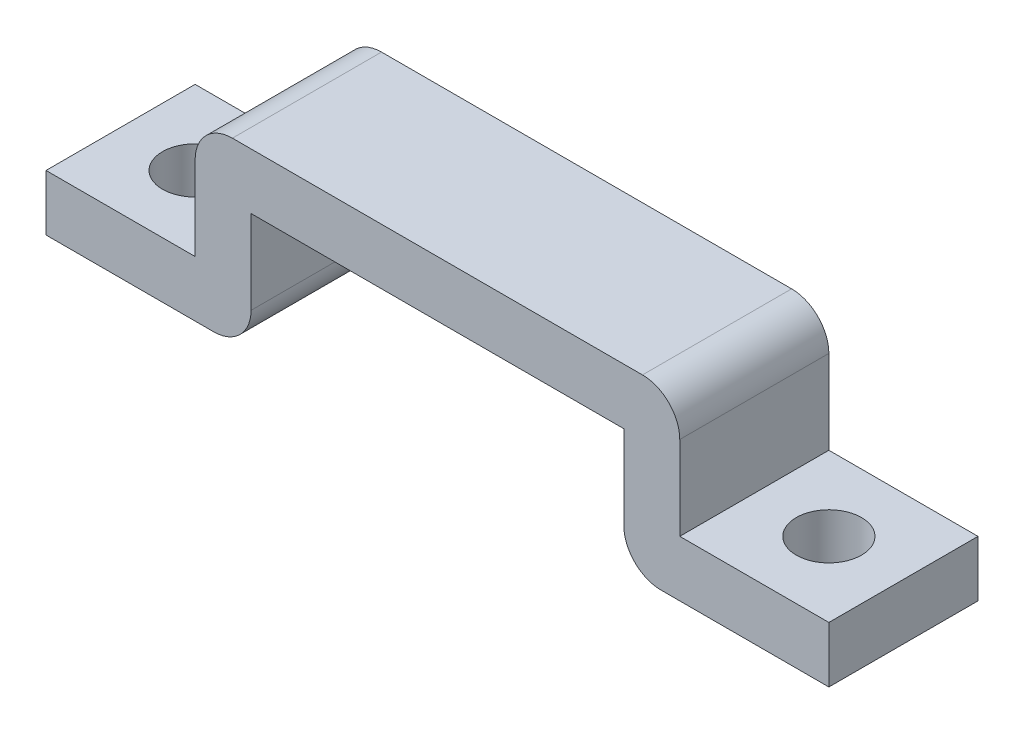
ISO-10303-21;
HEADER;
FILE_DESCRIPTION(('STEP AP214'),'2;1');
FILE_NAME('part.step','',(''),(''),'','','');
FILE_SCHEMA(('AUTOMOTIVE_DESIGN { 1 0 10303 214 1 1 1 1 }'));
ENDSEC;
DATA;
#1=APPLICATION_CONTEXT('core data for automotive mechanical design processes');
#2=APPLICATION_PROTOCOL_DEFINITION('international standard','automotive_design',2000,#1);
#3=PRODUCT_CONTEXT('',#1,'mechanical');
#4=PRODUCT('Part','Part','',(#3));
#5=PRODUCT_RELATED_PRODUCT_CATEGORY('part','',(#4));
#6=PRODUCT_DEFINITION_FORMATION('','',#4);
#7=PRODUCT_DEFINITION_CONTEXT('part definition',#1,'design');
#8=PRODUCT_DEFINITION('design','',#6,#7);
#9=PRODUCT_DEFINITION_SHAPE('','',#8);
#10=(LENGTH_UNIT() NAMED_UNIT(*) SI_UNIT(.MILLI.,.METRE.));
#11=(NAMED_UNIT(*) PLANE_ANGLE_UNIT() SI_UNIT($,.RADIAN.));
#12=(NAMED_UNIT(*) SI_UNIT($,.STERADIAN.) SOLID_ANGLE_UNIT());
#13=UNCERTAINTY_MEASURE_WITH_UNIT(LENGTH_MEASURE(1.E-05),#10,'distance_accuracy_value','');
#14=(GEOMETRIC_REPRESENTATION_CONTEXT(3) GLOBAL_UNCERTAINTY_ASSIGNED_CONTEXT((#13)) GLOBAL_UNIT_ASSIGNED_CONTEXT((#10,
#11,#12)) REPRESENTATION_CONTEXT('',''));
#15=CARTESIAN_POINT('',(0.,0.,0.));
#16=DIRECTION('',(0.,0.,1.));
#17=DIRECTION('',(1.,0.,0.));
#18=AXIS2_PLACEMENT_3D('',#15,#16,#17);
#19=CARTESIAN_POINT('',(10.,2.00000000000002,8.));
#20=DIRECTION('',(1.,0.,0.));
#21=DIRECTION('',(0.,0.,-1.));
#22=AXIS2_PLACEMENT_3D('',#19,#20,#21);
#23=PLANE('',#22);
#24=DIRECTION('',(0.,-1.,0.));
#25=VECTOR('',#24,1.);
#26=CARTESIAN_POINT('',(10.,2.00000000000002,0.));
#27=LINE('',#26,#25);
#28=CARTESIAN_POINT('',(10.,6.5,0.));
#29=VERTEX_POINT('',#28);
#30=CARTESIAN_POINT('',(10.,2.00000000000002,0.));
#31=VERTEX_POINT('',#30);
#32=EDGE_CURVE('E177',#29,#31,#27,.T.);
#33=ORIENTED_EDGE('',*,*,#32,.T.);
#34=DIRECTION('',(0.,0.,-1.));
#35=VECTOR('',#34,1.);
#36=CARTESIAN_POINT('',(10.,2.00000000000002,8.));
#37=LINE('',#36,#35);
#38=CARTESIAN_POINT('',(10.,2.00000000000002,8.));
#39=VERTEX_POINT('',#38);
#40=EDGE_CURVE('E11',#39,#31,#37,.T.);
#41=ORIENTED_EDGE('',*,*,#40,.F.);
#42=DIRECTION('',(0.,-1.,0.));
#43=VECTOR('',#42,1.);
#44=CARTESIAN_POINT('',(10.,2.00000000000002,8.));
#45=LINE('',#44,#43);
#46=CARTESIAN_POINT('',(10.,6.5,8.));
#47=VERTEX_POINT('',#46);
#48=EDGE_CURVE('E208',#47,#39,#45,.T.);
#49=ORIENTED_EDGE('',*,*,#48,.F.);
#50=DIRECTION('',(0.,0.,-1.));
#51=VECTOR('',#50,1.);
#52=CARTESIAN_POINT('',(10.,6.5,8.));
#53=LINE('',#52,#51);
#54=EDGE_CURVE('E173',#47,#29,#53,.T.);
#55=ORIENTED_EDGE('',*,*,#54,.T.);
#56=EDGE_LOOP('',(#33,#41,#49,#55));
#57=FACE_BOUND('',#56,.T.);
#58=ADVANCED_FACE('F33',(#57),#23,.F.);
#59=CARTESIAN_POINT('',(12.,2.,8.));
#60=DIRECTION('',(0.,0.,-1.));
#61=DIRECTION('',(-1.,0.,0.));
#62=AXIS2_PLACEMENT_3D('',#59,#60,#61);
#63=CYLINDRICAL_SURFACE('',#62,2.);
#64=CARTESIAN_POINT('',(12.,2.,0.));
#65=DIRECTION('',(0.,0.,1.));
#66=DIRECTION('',(1.,0.,0.));
#67=AXIS2_PLACEMENT_3D('',#64,#65,#66);
#68=CIRCLE('',#67,2.);
#69=CARTESIAN_POINT('',(12.,0.,0.));
#70=VERTEX_POINT('',#69);
#71=EDGE_CURVE('E180',#31,#70,#68,.T.);
#72=ORIENTED_EDGE('',*,*,#71,.T.);
#73=DIRECTION('',(0.,0.,-1.));
#74=VECTOR('',#73,1.);
#75=CARTESIAN_POINT('',(12.,0.,8.));
#76=LINE('',#75,#74);
#77=CARTESIAN_POINT('',(12.,0.,8.));
#78=VERTEX_POINT('',#77);
#79=EDGE_CURVE('E41',#78,#70,#76,.T.);
#80=ORIENTED_EDGE('',*,*,#79,.F.);
#81=CARTESIAN_POINT('',(12.,2.,8.));
#82=DIRECTION('',(0.,0.,1.));
#83=DIRECTION('',(1.,0.,0.));
#84=AXIS2_PLACEMENT_3D('',#81,#82,#83);
#85=CIRCLE('',#84,2.);
#86=EDGE_CURVE('E116',#39,#78,#85,.T.);
#87=ORIENTED_EDGE('',*,*,#86,.F.);
#88=ORIENTED_EDGE('',*,*,#40,.T.);
#89=EDGE_LOOP('',(#72,#80,#87,#88));
#90=FACE_BOUND('',#89,.T.);
#91=ADVANCED_FACE('F306',(#90),#63,.T.);
#92=CARTESIAN_POINT('',(21.,0.,8.));
#93=DIRECTION('',(0.,1.,0.));
#94=DIRECTION('',(-1.,0.,0.));
#95=AXIS2_PLACEMENT_3D('',#92,#93,#94);
#96=PLANE('',#95);
#97=CARTESIAN_POINT('',(17.,0.,3.99999999999999));
#98=DIRECTION('',(0.,1.,0.));
#99=DIRECTION('',(1.,0.,0.));
#100=AXIS2_PLACEMENT_3D('',#97,#98,#99);
#101=CIRCLE('',#100,1.75);
#102=CARTESIAN_POINT('',(18.75,0.,3.99999999999999));
#103=VERTEX_POINT('',#102);
#104=EDGE_CURVE('E431',#103,#103,#101,.T.);
#105=ORIENTED_EDGE('',*,*,#104,.T.);
#106=EDGE_LOOP('',(#105));
#107=FACE_BOUND('',#106,.T.);
#108=DIRECTION('',(1.,0.,0.));
#109=VECTOR('',#108,1.);
#110=CARTESIAN_POINT('',(21.,0.,0.));
#111=LINE('',#110,#109);
#112=CARTESIAN_POINT('',(21.,0.,0.));
#113=VERTEX_POINT('',#112);
#114=EDGE_CURVE('E183',#70,#113,#111,.T.);
#115=ORIENTED_EDGE('',*,*,#114,.T.);
#116=DIRECTION('',(0.,0.,-1.));
#117=VECTOR('',#116,1.);
#118=CARTESIAN_POINT('',(21.,0.,8.));
#119=LINE('',#118,#117);
#120=CARTESIAN_POINT('',(21.,0.,8.));
#121=VERTEX_POINT('',#120);
#122=EDGE_CURVE('E239',#121,#113,#119,.T.);
#123=ORIENTED_EDGE('',*,*,#122,.F.);
#124=DIRECTION('',(1.,0.,0.));
#125=VECTOR('',#124,1.);
#126=CARTESIAN_POINT('',(21.,0.,8.));
#127=LINE('',#126,#125);
#128=EDGE_CURVE('E247',#78,#121,#127,.T.);
#129=ORIENTED_EDGE('',*,*,#128,.F.);
#130=ORIENTED_EDGE('',*,*,#79,.T.);
#131=EDGE_LOOP('',(#115,#123,#129,#130));
#132=FACE_BOUND('',#131,.T.);
#133=ADVANCED_FACE('F245',(#107,#132),#96,.F.);
#134=CARTESIAN_POINT('',(21.,3.00000000000001,8.));
#135=DIRECTION('',(-1.,0.,0.));
#136=DIRECTION('',(0.,-1.,0.));
#137=AXIS2_PLACEMENT_3D('',#134,#135,#136);
#138=PLANE('',#137);
#139=DIRECTION('',(0.,1.,0.));
#140=VECTOR('',#139,1.);
#141=CARTESIAN_POINT('',(21.,3.00000000000001,0.));
#142=LINE('',#141,#140);
#143=CARTESIAN_POINT('',(21.,3.00000000000001,0.));
#144=VERTEX_POINT('',#143);
#145=EDGE_CURVE('E185',#113,#144,#142,.T.);
#146=ORIENTED_EDGE('',*,*,#145,.T.);
#147=DIRECTION('',(0.,0.,-1.));
#148=VECTOR('',#147,1.);
#149=CARTESIAN_POINT('',(21.,3.00000000000001,8.));
#150=LINE('',#149,#148);
#151=CARTESIAN_POINT('',(21.,3.00000000000001,8.));
#152=VERTEX_POINT('',#151);
#153=EDGE_CURVE('E236',#152,#144,#150,.T.);
#154=ORIENTED_EDGE('',*,*,#153,.F.);
#155=DIRECTION('',(0.,1.,0.));
#156=VECTOR('',#155,1.);
#157=CARTESIAN_POINT('',(21.,3.00000000000001,8.));
#158=LINE('',#157,#156);
#159=EDGE_CURVE('E265',#121,#152,#158,.T.);
#160=ORIENTED_EDGE('',*,*,#159,.F.);
#161=ORIENTED_EDGE('',*,*,#122,.T.);
#162=EDGE_LOOP('',(#146,#154,#160,#161));
#163=FACE_BOUND('',#162,.T.);
#164=ADVANCED_FACE('F256',(#163),#138,.F.);
#165=CARTESIAN_POINT('',(13.,3.,8.));
#166=DIRECTION('',(0.,-1.,0.));
#167=DIRECTION('',(1.,0.,0.));
#168=AXIS2_PLACEMENT_3D('',#165,#166,#167);
#169=PLANE('',#168);
#170=CARTESIAN_POINT('',(17.,3.00000000000001,3.99999999999999));
#171=DIRECTION('',(0.,1.,0.));
#172=DIRECTION('',(1.,0.,0.));
#173=AXIS2_PLACEMENT_3D('',#170,#171,#172);
#174=CIRCLE('',#173,1.75);
#175=CARTESIAN_POINT('',(18.75,3.00000000000001,3.99999999999999));
#176=VERTEX_POINT('',#175);
#177=EDGE_CURVE('E434',#176,#176,#174,.T.);
#178=ORIENTED_EDGE('',*,*,#177,.F.);
#179=EDGE_LOOP('',(#178));
#180=FACE_BOUND('',#179,.T.);
#181=DIRECTION('',(-1.,0.,0.));
#182=VECTOR('',#181,1.);
#183=CARTESIAN_POINT('',(13.,3.,0.));
#184=LINE('',#183,#182);
#185=CARTESIAN_POINT('',(13.,3.,0.));
#186=VERTEX_POINT('',#185);
#187=EDGE_CURVE('E187',#144,#186,#184,.T.);
#188=ORIENTED_EDGE('',*,*,#187,.T.);
#189=DIRECTION('',(0.,0.,-1.));
#190=VECTOR('',#189,1.);
#191=CARTESIAN_POINT('',(13.,3.,8.));
#192=LINE('',#191,#190);
#193=CARTESIAN_POINT('',(13.,3.,8.));
#194=VERTEX_POINT('',#193);
#195=EDGE_CURVE('E233',#194,#186,#192,.T.);
#196=ORIENTED_EDGE('',*,*,#195,.F.);
#197=DIRECTION('',(-1.,0.,0.));
#198=VECTOR('',#197,1.);
#199=CARTESIAN_POINT('',(13.,3.,8.));
#200=LINE('',#199,#198);
#201=EDGE_CURVE('E262',#152,#194,#200,.T.);
#202=ORIENTED_EDGE('',*,*,#201,.F.);
#203=ORIENTED_EDGE('',*,*,#153,.T.);
#204=EDGE_LOOP('',(#188,#196,#202,#203));
#205=FACE_BOUND('',#204,.T.);
#206=ADVANCED_FACE('F260',(#180,#205),#169,.F.);
#207=CARTESIAN_POINT('',(13.,7.49999999999999,8.));
#208=DIRECTION('',(-1.,0.,0.));
#209=DIRECTION('',(0.,-1.,0.));
#210=AXIS2_PLACEMENT_3D('',#207,#208,#209);
#211=PLANE('',#210);
#212=DIRECTION('',(0.,1.,0.));
#213=VECTOR('',#212,1.);
#214=CARTESIAN_POINT('',(13.,7.49999999999999,0.));
#215=LINE('',#214,#213);
#216=CARTESIAN_POINT('',(13.,7.49999999999999,0.));
#217=VERTEX_POINT('',#216);
#218=EDGE_CURVE('E189',#186,#217,#215,.T.);
#219=ORIENTED_EDGE('',*,*,#218,.T.);
#220=DIRECTION('',(0.,0.,-1.));
#221=VECTOR('',#220,1.);
#222=CARTESIAN_POINT('',(13.,7.49999999999999,8.));
#223=LINE('',#222,#221);
#224=CARTESIAN_POINT('',(13.,7.49999999999999,8.));
#225=VERTEX_POINT('',#224);
#226=EDGE_CURVE('E230',#225,#217,#223,.T.);
#227=ORIENTED_EDGE('',*,*,#226,.F.);
#228=DIRECTION('',(0.,1.,0.));
#229=VECTOR('',#228,1.);
#230=CARTESIAN_POINT('',(13.,7.49999999999999,8.));
#231=LINE('',#230,#229);
#232=EDGE_CURVE('E264',#194,#225,#231,.T.);
#233=ORIENTED_EDGE('',*,*,#232,.F.);
#234=ORIENTED_EDGE('',*,*,#195,.T.);
#235=EDGE_LOOP('',(#219,#227,#233,#234));
#236=FACE_BOUND('',#235,.T.);
#237=ADVANCED_FACE('F320',(#236),#211,.F.);
#238=CARTESIAN_POINT('',(11.,7.5,8.));
#239=DIRECTION('',(0.,0.,-1.));
#240=DIRECTION('',(-1.,0.,0.));
#241=AXIS2_PLACEMENT_3D('',#238,#239,#240);
#242=CYLINDRICAL_SURFACE('',#241,2.);
#243=CARTESIAN_POINT('',(11.,7.5,0.));
#244=DIRECTION('',(0.,0.,1.));
#245=DIRECTION('',(1.,0.,0.));
#246=AXIS2_PLACEMENT_3D('',#243,#244,#245);
#247=CIRCLE('',#246,2.);
#248=CARTESIAN_POINT('',(11.,9.5,0.));
#249=VERTEX_POINT('',#248);
#250=EDGE_CURVE('E191',#217,#249,#247,.T.);
#251=ORIENTED_EDGE('',*,*,#250,.T.);
#252=DIRECTION('',(0.,0.,-1.));
#253=VECTOR('',#252,1.);
#254=CARTESIAN_POINT('',(11.,9.5,8.));
#255=LINE('',#254,#253);
#256=CARTESIAN_POINT('',(11.,9.5,8.));
#257=VERTEX_POINT('',#256);
#258=EDGE_CURVE('E227',#257,#249,#255,.T.);
#259=ORIENTED_EDGE('',*,*,#258,.F.);
#260=CARTESIAN_POINT('',(11.,7.5,8.));
#261=DIRECTION('',(0.,0.,1.));
#262=DIRECTION('',(1.,0.,0.));
#263=AXIS2_PLACEMENT_3D('',#260,#261,#262);
#264=CIRCLE('',#263,2.);
#265=EDGE_CURVE('E267',#225,#257,#264,.T.);
#266=ORIENTED_EDGE('',*,*,#265,.F.);
#267=ORIENTED_EDGE('',*,*,#226,.T.);
#268=EDGE_LOOP('',(#251,#259,#266,#267));
#269=FACE_BOUND('',#268,.T.);
#270=ADVANCED_FACE('F324',(#269),#242,.T.);
#271=CARTESIAN_POINT('',(11.,9.5,8.));
#272=DIRECTION('',(0.,-1.,0.));
#273=DIRECTION('',(0.,0.,-1.));
#274=AXIS2_PLACEMENT_3D('',#271,#272,#273);
#275=PLANE('',#274);
#276=DIRECTION('',(-1.,0.,0.));
#277=VECTOR('',#276,1.);
#278=CARTESIAN_POINT('',(11.,9.5,0.));
#279=LINE('',#278,#277);
#280=CARTESIAN_POINT('',(-11.,9.5,0.));
#281=VERTEX_POINT('',#280);
#282=EDGE_CURVE('E193',#249,#281,#279,.T.);
#283=ORIENTED_EDGE('',*,*,#282,.T.);
#284=DIRECTION('',(0.,0.,-1.));
#285=VECTOR('',#284,1.);
#286=CARTESIAN_POINT('',(-11.,9.5,8.));
#287=LINE('',#286,#285);
#288=CARTESIAN_POINT('',(-11.,9.5,8.));
#289=VERTEX_POINT('',#288);
#290=EDGE_CURVE('E224',#289,#281,#287,.T.);
#291=ORIENTED_EDGE('',*,*,#290,.F.);
#292=DIRECTION('',(-1.,0.,0.));
#293=VECTOR('',#292,1.);
#294=CARTESIAN_POINT('',(11.,9.5,8.));
#295=LINE('',#294,#293);
#296=EDGE_CURVE('E273',#257,#289,#295,.T.);
#297=ORIENTED_EDGE('',*,*,#296,.F.);
#298=ORIENTED_EDGE('',*,*,#258,.T.);
#299=EDGE_LOOP('',(#283,#291,#297,#298));
#300=FACE_BOUND('',#299,.T.);
#301=ADVANCED_FACE('F328',(#300),#275,.F.);
#302=CARTESIAN_POINT('',(-11.,7.5,8.));
#303=DIRECTION('',(0.,0.,-1.));
#304=DIRECTION('',(-1.,0.,0.));
#305=AXIS2_PLACEMENT_3D('',#302,#303,#304);
#306=CYLINDRICAL_SURFACE('',#305,2.);
#307=CARTESIAN_POINT('',(-11.,7.5,0.));
#308=DIRECTION('',(0.,0.,1.));
#309=DIRECTION('',(1.,0.,0.));
#310=AXIS2_PLACEMENT_3D('',#307,#308,#309);
#311=CIRCLE('',#310,2.);
#312=CARTESIAN_POINT('',(-13.,7.49999999999999,0.));
#313=VERTEX_POINT('',#312);
#314=EDGE_CURVE('E195',#281,#313,#311,.T.);
#315=ORIENTED_EDGE('',*,*,#314,.T.);
#316=DIRECTION('',(0.,0.,-1.));
#317=VECTOR('',#316,1.);
#318=CARTESIAN_POINT('',(-13.,7.49999999999999,8.));
#319=LINE('',#318,#317);
#320=CARTESIAN_POINT('',(-13.,7.49999999999999,8.));
#321=VERTEX_POINT('',#320);
#322=EDGE_CURVE('E221',#321,#313,#319,.T.);
#323=ORIENTED_EDGE('',*,*,#322,.F.);
#324=CARTESIAN_POINT('',(-11.,7.5,8.));
#325=DIRECTION('',(0.,0.,1.));
#326=DIRECTION('',(1.,0.,0.));
#327=AXIS2_PLACEMENT_3D('',#324,#325,#326);
#328=CIRCLE('',#327,2.);
#329=EDGE_CURVE('E275',#289,#321,#328,.T.);
#330=ORIENTED_EDGE('',*,*,#329,.F.);
#331=ORIENTED_EDGE('',*,*,#290,.T.);
#332=EDGE_LOOP('',(#315,#323,#330,#331));
#333=FACE_BOUND('',#332,.T.);
#334=ADVANCED_FACE('F332',(#333),#306,.T.);
#335=CARTESIAN_POINT('',(-13.,7.49999999999999,8.));
#336=DIRECTION('',(1.,0.,0.));
#337=DIRECTION('',(0.,1.,0.));
#338=AXIS2_PLACEMENT_3D('',#335,#336,#337);
#339=PLANE('',#338);
#340=DIRECTION('',(0.,-1.,0.));
#341=VECTOR('',#340,1.);
#342=CARTESIAN_POINT('',(-13.,7.49999999999999,0.));
#343=LINE('',#342,#341);
#344=CARTESIAN_POINT('',(-13.,3.,0.));
#345=VERTEX_POINT('',#344);
#346=EDGE_CURVE('E197',#313,#345,#343,.T.);
#347=ORIENTED_EDGE('',*,*,#346,.T.);
#348=DIRECTION('',(0.,0.,-1.));
#349=VECTOR('',#348,1.);
#350=CARTESIAN_POINT('',(-13.,3.,8.));
#351=LINE('',#350,#349);
#352=CARTESIAN_POINT('',(-13.,3.,8.));
#353=VERTEX_POINT('',#352);
#354=EDGE_CURVE('E218',#353,#345,#351,.T.);
#355=ORIENTED_EDGE('',*,*,#354,.F.);
#356=DIRECTION('',(0.,-1.,0.));
#357=VECTOR('',#356,1.);
#358=CARTESIAN_POINT('',(-13.,7.49999999999999,8.));
#359=LINE('',#358,#357);
#360=EDGE_CURVE('E277',#321,#353,#359,.T.);
#361=ORIENTED_EDGE('',*,*,#360,.F.);
#362=ORIENTED_EDGE('',*,*,#322,.T.);
#363=EDGE_LOOP('',(#347,#355,#361,#362));
#364=FACE_BOUND('',#363,.T.);
#365=ADVANCED_FACE('F336',(#364),#339,.F.);
#366=CARTESIAN_POINT('',(-13.,3.,8.));
#367=DIRECTION('',(0.,-1.,0.));
#368=DIRECTION('',(1.,0.,0.));
#369=AXIS2_PLACEMENT_3D('',#366,#367,#368);
#370=PLANE('',#369);
#371=CARTESIAN_POINT('',(-17.,3.00000000000001,4.));
#372=DIRECTION('',(0.,1.,0.));
#373=DIRECTION('',(-1.,0.,0.));
#374=AXIS2_PLACEMENT_3D('',#371,#372,#373);
#375=CIRCLE('',#374,1.75);
#376=CARTESIAN_POINT('',(-18.75,3.00000000000001,4.));
#377=VERTEX_POINT('',#376);
#378=EDGE_CURVE('E436',#377,#377,#375,.T.);
#379=ORIENTED_EDGE('',*,*,#378,.F.);
#380=EDGE_LOOP('',(#379));
#381=FACE_BOUND('',#380,.T.);
#382=DIRECTION('',(-1.,0.,0.));
#383=VECTOR('',#382,1.);
#384=CARTESIAN_POINT('',(-13.,3.,0.));
#385=LINE('',#384,#383);
#386=CARTESIAN_POINT('',(-21.,3.,0.));
#387=VERTEX_POINT('',#386);
#388=EDGE_CURVE('E199',#345,#387,#385,.T.);
#389=ORIENTED_EDGE('',*,*,#388,.T.);
#390=DIRECTION('',(0.,0.,-1.));
#391=VECTOR('',#390,1.);
#392=CARTESIAN_POINT('',(-21.,3.,8.));
#393=LINE('',#392,#391);
#394=CARTESIAN_POINT('',(-21.,3.,8.));
#395=VERTEX_POINT('',#394);
#396=EDGE_CURVE('E215',#395,#387,#393,.T.);
#397=ORIENTED_EDGE('',*,*,#396,.F.);
#398=DIRECTION('',(-1.,0.,0.));
#399=VECTOR('',#398,1.);
#400=CARTESIAN_POINT('',(-13.,3.,8.));
#401=LINE('',#400,#399);
#402=EDGE_CURVE('E279',#353,#395,#401,.T.);
#403=ORIENTED_EDGE('',*,*,#402,.F.);
#404=ORIENTED_EDGE('',*,*,#354,.T.);
#405=EDGE_LOOP('',(#389,#397,#403,#404));
#406=FACE_BOUND('',#405,.T.);
#407=ADVANCED_FACE('F340',(#381,#406),#370,.F.);
#408=CARTESIAN_POINT('',(-21.,3.,8.));
#409=DIRECTION('',(1.,0.,0.));
#410=DIRECTION('',(0.,0.,-1.));
#411=AXIS2_PLACEMENT_3D('',#408,#409,#410);
#412=PLANE('',#411);
#413=DIRECTION('',(0.,-1.,0.));
#414=VECTOR('',#413,1.);
#415=CARTESIAN_POINT('',(-21.,3.,0.));
#416=LINE('',#415,#414);
#417=CARTESIAN_POINT('',(-21.,0.,0.));
#418=VERTEX_POINT('',#417);
#419=EDGE_CURVE('E201',#387,#418,#416,.T.);
#420=ORIENTED_EDGE('',*,*,#419,.T.);
#421=DIRECTION('',(0.,0.,-1.));
#422=VECTOR('',#421,1.);
#423=CARTESIAN_POINT('',(-21.,0.,8.));
#424=LINE('',#423,#422);
#425=CARTESIAN_POINT('',(-21.,0.,8.));
#426=VERTEX_POINT('',#425);
#427=EDGE_CURVE('E212',#426,#418,#424,.T.);
#428=ORIENTED_EDGE('',*,*,#427,.F.);
#429=DIRECTION('',(0.,-1.,0.));
#430=VECTOR('',#429,1.);
#431=CARTESIAN_POINT('',(-21.,3.,8.));
#432=LINE('',#431,#430);
#433=EDGE_CURVE('E281',#395,#426,#432,.T.);
#434=ORIENTED_EDGE('',*,*,#433,.F.);
#435=ORIENTED_EDGE('',*,*,#396,.T.);
#436=EDGE_LOOP('',(#420,#428,#434,#435));
#437=FACE_BOUND('',#436,.T.);
#438=ADVANCED_FACE('F287',(#437),#412,.F.);
#439=CARTESIAN_POINT('',(-21.,0.,8.));
#440=DIRECTION('',(0.,1.,0.));
#441=DIRECTION('',(-1.,0.,0.));
#442=AXIS2_PLACEMENT_3D('',#439,#440,#441);
#443=PLANE('',#442);
#444=CARTESIAN_POINT('',(-17.,0.,4.));
#445=DIRECTION('',(0.,1.,0.));
#446=DIRECTION('',(-1.,0.,0.));
#447=AXIS2_PLACEMENT_3D('',#444,#445,#446);
#448=CIRCLE('',#447,1.75);
#449=CARTESIAN_POINT('',(-18.75,0.,4.));
#450=VERTEX_POINT('',#449);
#451=EDGE_CURVE('E181',#450,#450,#448,.T.);
#452=ORIENTED_EDGE('',*,*,#451,.T.);
#453=EDGE_LOOP('',(#452));
#454=FACE_BOUND('',#453,.T.);
#455=DIRECTION('',(1.,0.,0.));
#456=VECTOR('',#455,1.);
#457=CARTESIAN_POINT('',(-21.,0.,0.));
#458=LINE('',#457,#456);
#459=CARTESIAN_POINT('',(-12.,0.,0.));
#460=VERTEX_POINT('',#459);
#461=EDGE_CURVE('E203',#418,#460,#458,.T.);
#462=ORIENTED_EDGE('',*,*,#461,.T.);
#463=DIRECTION('',(0.,0.,-1.));
#464=VECTOR('',#463,1.);
#465=CARTESIAN_POINT('',(-12.,0.,8.));
#466=LINE('',#465,#464);
#467=CARTESIAN_POINT('',(-12.,0.,8.));
#468=VERTEX_POINT('',#467);
#469=EDGE_CURVE('E168',#468,#460,#466,.T.);
#470=ORIENTED_EDGE('',*,*,#469,.F.);
#471=DIRECTION('',(1.,0.,0.));
#472=VECTOR('',#471,1.);
#473=CARTESIAN_POINT('',(-21.,0.,8.));
#474=LINE('',#473,#472);
#475=EDGE_CURVE('E159',#426,#468,#474,.T.);
#476=ORIENTED_EDGE('',*,*,#475,.F.);
#477=ORIENTED_EDGE('',*,*,#427,.T.);
#478=EDGE_LOOP('',(#462,#470,#476,#477));
#479=FACE_BOUND('',#478,.T.);
#480=ADVANCED_FACE('F291',(#454,#479),#443,.F.);
#481=CARTESIAN_POINT('',(-12.,2.,8.));
#482=DIRECTION('',(0.,0.,-1.));
#483=DIRECTION('',(-1.,0.,0.));
#484=AXIS2_PLACEMENT_3D('',#481,#482,#483);
#485=CYLINDRICAL_SURFACE('',#484,2.);
#486=CARTESIAN_POINT('',(-12.,2.,0.));
#487=DIRECTION('',(0.,0.,1.));
#488=DIRECTION('',(1.,0.,0.));
#489=AXIS2_PLACEMENT_3D('',#486,#487,#488);
#490=CIRCLE('',#489,2.);
#491=CARTESIAN_POINT('',(-10.,2.00000000000002,0.));
#492=VERTEX_POINT('',#491);
#493=EDGE_CURVE('E167',#460,#492,#490,.T.);
#494=ORIENTED_EDGE('',*,*,#493,.T.);
#495=DIRECTION('',(0.,0.,-1.));
#496=VECTOR('',#495,1.);
#497=CARTESIAN_POINT('',(-10.,2.00000000000002,8.));
#498=LINE('',#497,#496);
#499=CARTESIAN_POINT('',(-10.,2.00000000000002,8.));
#500=VERTEX_POINT('',#499);
#501=EDGE_CURVE('E164',#500,#492,#498,.T.);
#502=ORIENTED_EDGE('',*,*,#501,.F.);
#503=CARTESIAN_POINT('',(-12.,2.,8.));
#504=DIRECTION('',(0.,0.,1.));
#505=DIRECTION('',(1.,0.,0.));
#506=AXIS2_PLACEMENT_3D('',#503,#504,#505);
#507=CIRCLE('',#506,2.);
#508=EDGE_CURVE('E153',#468,#500,#507,.T.);
#509=ORIENTED_EDGE('',*,*,#508,.F.);
#510=ORIENTED_EDGE('',*,*,#469,.T.);
#511=EDGE_LOOP('',(#494,#502,#509,#510));
#512=FACE_BOUND('',#511,.T.);
#513=ADVANCED_FACE('F165',(#512),#485,.T.);
#514=CARTESIAN_POINT('',(-10.,2.00000000000002,8.));
#515=DIRECTION('',(-1.,0.,0.));
#516=DIRECTION('',(0.,0.,1.));
#517=AXIS2_PLACEMENT_3D('',#514,#515,#516);
#518=PLANE('',#517);
#519=DIRECTION('',(0.,1.,0.));
#520=VECTOR('',#519,1.);
#521=CARTESIAN_POINT('',(-10.,2.00000000000002,0.));
#522=LINE('',#521,#520);
#523=CARTESIAN_POINT('',(-10.,6.5,0.));
#524=VERTEX_POINT('',#523);
#525=EDGE_CURVE('E102',#492,#524,#522,.T.);
#526=ORIENTED_EDGE('',*,*,#525,.T.);
#527=DIRECTION('',(0.,0.,-1.));
#528=VECTOR('',#527,1.);
#529=CARTESIAN_POINT('',(-10.,6.5,8.));
#530=LINE('',#529,#528);
#531=CARTESIAN_POINT('',(-10.,6.5,8.));
#532=VERTEX_POINT('',#531);
#533=EDGE_CURVE('E169',#532,#524,#530,.T.);
#534=ORIENTED_EDGE('',*,*,#533,.F.);
#535=DIRECTION('',(0.,1.,0.));
#536=VECTOR('',#535,1.);
#537=CARTESIAN_POINT('',(-10.,2.00000000000002,8.));
#538=LINE('',#537,#536);
#539=EDGE_CURVE('E157',#500,#532,#538,.T.);
#540=ORIENTED_EDGE('',*,*,#539,.F.);
#541=ORIENTED_EDGE('',*,*,#501,.T.);
#542=EDGE_LOOP('',(#526,#534,#540,#541));
#543=FACE_BOUND('',#542,.T.);
#544=ADVANCED_FACE('F171',(#543),#518,.F.);
#545=CARTESIAN_POINT('',(-10.,6.5,8.));
#546=DIRECTION('',(0.,1.,0.));
#547=DIRECTION('',(0.,0.,1.));
#548=AXIS2_PLACEMENT_3D('',#545,#546,#547);
#549=PLANE('',#548);
#550=DIRECTION('',(1.,0.,0.));
#551=VECTOR('',#550,1.);
#552=CARTESIAN_POINT('',(-10.,6.5,0.));
#553=LINE('',#552,#551);
#554=EDGE_CURVE('E108',#524,#29,#553,.T.);
#555=ORIENTED_EDGE('',*,*,#554,.T.);
#556=ORIENTED_EDGE('',*,*,#54,.F.);
#557=DIRECTION('',(1.,0.,0.));
#558=VECTOR('',#557,1.);
#559=CARTESIAN_POINT('',(-10.,6.5,8.));
#560=LINE('',#559,#558);
#561=EDGE_CURVE('E49',#532,#47,#560,.T.);
#562=ORIENTED_EDGE('',*,*,#561,.F.);
#563=ORIENTED_EDGE('',*,*,#533,.T.);
#564=EDGE_LOOP('',(#555,#556,#562,#563));
#565=FACE_BOUND('',#564,.T.);
#566=ADVANCED_FACE('F295',(#565),#549,.F.);
#567=CARTESIAN_POINT('',(-12.,2.,8.));
#568=DIRECTION('',(0.,0.,1.));
#569=DIRECTION('',(1.,0.,0.));
#570=AXIS2_PLACEMENT_3D('',#567,#568,#569);
#571=PLANE('',#570);
#572=ORIENTED_EDGE('',*,*,#48,.T.);
#573=ORIENTED_EDGE('',*,*,#86,.T.);
#574=ORIENTED_EDGE('',*,*,#128,.T.);
#575=ORIENTED_EDGE('',*,*,#159,.T.);
#576=ORIENTED_EDGE('',*,*,#201,.T.);
#577=ORIENTED_EDGE('',*,*,#232,.T.);
#578=ORIENTED_EDGE('',*,*,#265,.T.);
#579=ORIENTED_EDGE('',*,*,#296,.T.);
#580=ORIENTED_EDGE('',*,*,#329,.T.);
#581=ORIENTED_EDGE('',*,*,#360,.T.);
#582=ORIENTED_EDGE('',*,*,#402,.T.);
#583=ORIENTED_EDGE('',*,*,#433,.T.);
#584=ORIENTED_EDGE('',*,*,#475,.T.);
#585=ORIENTED_EDGE('',*,*,#508,.T.);
#586=ORIENTED_EDGE('',*,*,#539,.T.);
#587=ORIENTED_EDGE('',*,*,#561,.T.);
#588=EDGE_LOOP('',(#572,#573,#574,#575,#576,#577,#578,#579,#580,#581,#582,#583,#584,#585,#586,#587));
#589=FACE_BOUND('',#588,.T.);
#590=ADVANCED_FACE('F155',(#589),#571,.T.);
#591=CARTESIAN_POINT('',(-12.,2.,0.));
#592=DIRECTION('',(0.,0.,1.));
#593=DIRECTION('',(1.,0.,0.));
#594=AXIS2_PLACEMENT_3D('',#591,#592,#593);
#595=PLANE('',#594);
#596=ORIENTED_EDGE('',*,*,#32,.F.);
#597=ORIENTED_EDGE('',*,*,#554,.F.);
#598=ORIENTED_EDGE('',*,*,#525,.F.);
#599=ORIENTED_EDGE('',*,*,#493,.F.);
#600=ORIENTED_EDGE('',*,*,#461,.F.);
#601=ORIENTED_EDGE('',*,*,#419,.F.);
#602=ORIENTED_EDGE('',*,*,#388,.F.);
#603=ORIENTED_EDGE('',*,*,#346,.F.);
#604=ORIENTED_EDGE('',*,*,#314,.F.);
#605=ORIENTED_EDGE('',*,*,#282,.F.);
#606=ORIENTED_EDGE('',*,*,#250,.F.);
#607=ORIENTED_EDGE('',*,*,#218,.F.);
#608=ORIENTED_EDGE('',*,*,#187,.F.);
#609=ORIENTED_EDGE('',*,*,#145,.F.);
#610=ORIENTED_EDGE('',*,*,#114,.F.);
#611=ORIENTED_EDGE('',*,*,#71,.F.);
#612=EDGE_LOOP('',(#596,#597,#598,#599,#600,#601,#602,#603,#604,#605,#606,#607,#608,#609,#610,#611));
#613=FACE_BOUND('',#612,.T.);
#614=ADVANCED_FACE('F251',(#613),#595,.F.);
#615=CARTESIAN_POINT('',(-17.,0.,4.));
#616=DIRECTION('',(0.,1.,0.));
#617=DIRECTION('',(-1.,0.,0.));
#618=AXIS2_PLACEMENT_3D('',#615,#616,#617);
#619=CYLINDRICAL_SURFACE('',#618,1.75);
#620=ORIENTED_EDGE('',*,*,#451,.F.);
#621=EDGE_LOOP('',(#620));
#622=FACE_BOUND('',#621,.T.);
#623=ORIENTED_EDGE('',*,*,#378,.T.);
#624=EDGE_LOOP('',(#623));
#625=FACE_BOUND('',#624,.T.);
#626=ADVANCED_FACE('F379',(#622,#625),#619,.F.);
#627=CARTESIAN_POINT('',(17.,0.,3.99999999999999));
#628=DIRECTION('',(0.,1.,0.));
#629=DIRECTION('',(-1.,0.,0.));
#630=AXIS2_PLACEMENT_3D('',#627,#628,#629);
#631=CYLINDRICAL_SURFACE('',#630,1.75);
#632=ORIENTED_EDGE('',*,*,#104,.F.);
#633=EDGE_LOOP('',(#632));
#634=FACE_BOUND('',#633,.T.);
#635=ORIENTED_EDGE('',*,*,#177,.T.);
#636=EDGE_LOOP('',(#635));
#637=FACE_BOUND('',#636,.T.);
#638=ADVANCED_FACE('F414',(#634,#637),#631,.F.);
#639=CLOSED_SHELL('',(#58,#91,#133,#164,#206,#237,#270,#301,#334,#365,#407,#438,#480,#513,#544,
#566,#590,#614,#626,#638));
#640=MANIFOLD_SOLID_BREP('B2',#639);
#641=ADVANCED_BREP_SHAPE_REPRESENTATION('',(#18,#640),#14);
#642=SHAPE_DEFINITION_REPRESENTATION(#9,#641);
ENDSEC;
END-ISO-10303-21;
